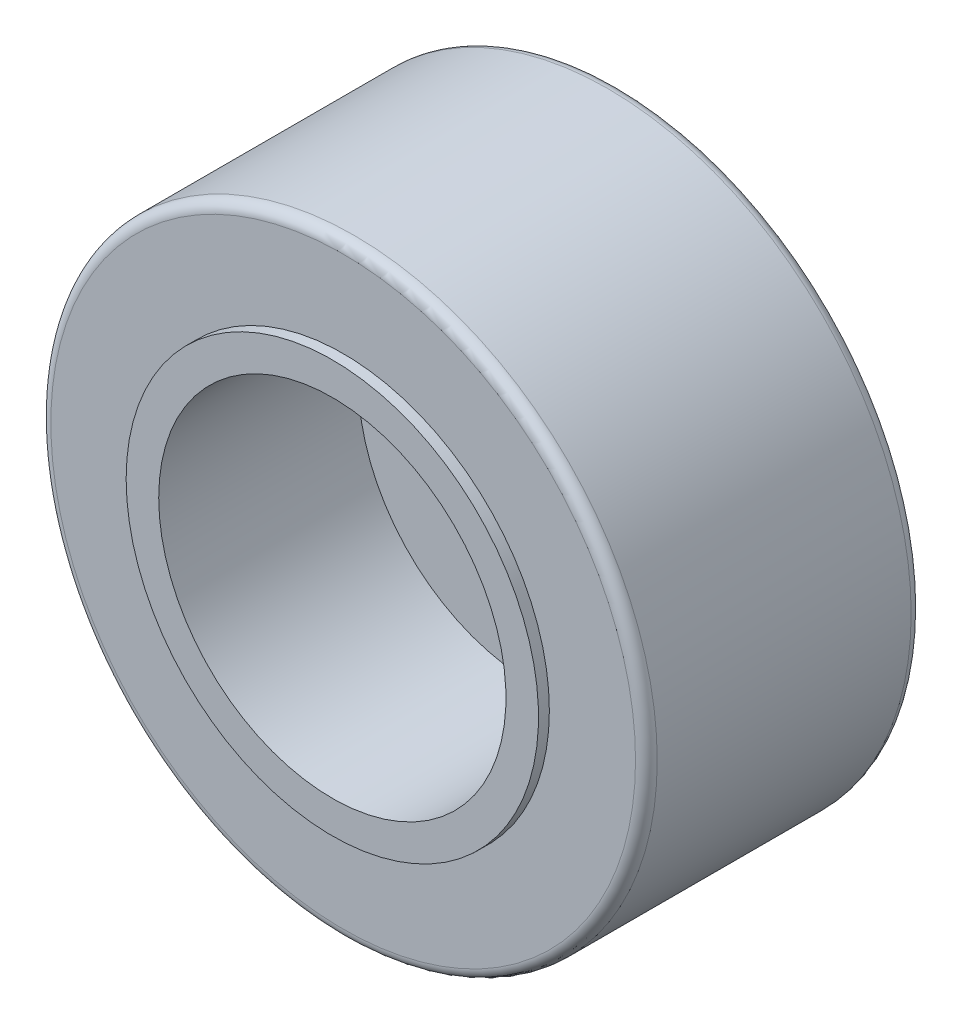
ISO-10303-21;
HEADER;
FILE_DESCRIPTION(('STEP AP214'),'2;1');
FILE_NAME('part.step','',(''),(''),'','','');
FILE_SCHEMA(('AUTOMOTIVE_DESIGN { 1 0 10303 214 1 1 1 1 }'));
ENDSEC;
DATA;
#1=APPLICATION_CONTEXT('core data for automotive mechanical design processes');
#2=APPLICATION_PROTOCOL_DEFINITION('international standard','automotive_design',2000,#1);
#3=PRODUCT_CONTEXT('',#1,'mechanical');
#4=PRODUCT('Part','Part','',(#3));
#5=PRODUCT_RELATED_PRODUCT_CATEGORY('part','',(#4));
#6=PRODUCT_DEFINITION_FORMATION('','',#4);
#7=PRODUCT_DEFINITION_CONTEXT('part definition',#1,'design');
#8=PRODUCT_DEFINITION('design','',#6,#7);
#9=PRODUCT_DEFINITION_SHAPE('','',#8);
#10=(LENGTH_UNIT() NAMED_UNIT(*) SI_UNIT(.MILLI.,.METRE.));
#11=(NAMED_UNIT(*) PLANE_ANGLE_UNIT() SI_UNIT($,.RADIAN.));
#12=(NAMED_UNIT(*) SI_UNIT($,.STERADIAN.) SOLID_ANGLE_UNIT());
#13=UNCERTAINTY_MEASURE_WITH_UNIT(LENGTH_MEASURE(1.E-05),#10,'distance_accuracy_value','');
#14=(GEOMETRIC_REPRESENTATION_CONTEXT(3) GLOBAL_UNCERTAINTY_ASSIGNED_CONTEXT((#13)) GLOBAL_UNIT_ASSIGNED_CONTEXT((#10,
#11,#12)) REPRESENTATION_CONTEXT('',''));
#15=CARTESIAN_POINT('',(0.,0.,0.));
#16=DIRECTION('',(0.,0.,1.));
#17=DIRECTION('',(1.,0.,0.));
#18=AXIS2_PLACEMENT_3D('',#15,#16,#17);
#19=CARTESIAN_POINT('',(0.,0.,12.7));
#20=DIRECTION('',(0.,0.,1.));
#21=DIRECTION('',(1.,0.,0.));
#22=AXIS2_PLACEMENT_3D('',#19,#20,#21);
#23=PLANE('',#22);
#24=CARTESIAN_POINT('',(0.,0.,12.7));
#25=DIRECTION('',(0.,0.,1.));
#26=DIRECTION('',(1.,0.,0.));
#27=AXIS2_PLACEMENT_3D('',#24,#25,#26);
#28=CIRCLE('',#27,9.5);
#29=CARTESIAN_POINT('',(9.5,0.,12.7));
#30=VERTEX_POINT('',#29);
#31=EDGE_CURVE('E10',#30,#30,#28,.T.);
#32=ORIENTED_EDGE('',*,*,#31,.F.);
#33=EDGE_LOOP('',(#32));
#34=FACE_BOUND('',#33,.T.);
#35=CARTESIAN_POINT('',(0.,0.,12.7));
#36=DIRECTION('',(0.,0.,1.));
#37=DIRECTION('',(1.,0.,0.));
#38=AXIS2_PLACEMENT_3D('',#35,#36,#37);
#39=CIRCLE('',#38,13.47);
#40=CARTESIAN_POINT('',(13.47,0.,12.7));
#41=VERTEX_POINT('',#40);
#42=EDGE_CURVE('E42',#41,#41,#39,.T.);
#43=ORIENTED_EDGE('',*,*,#42,.T.);
#44=EDGE_LOOP('',(#43));
#45=FACE_BOUND('',#44,.T.);
#46=ADVANCED_FACE('F35',(#34,#45),#23,.T.);
#47=CARTESIAN_POINT('',(0.,0.,0.));
#48=DIRECTION('',(0.,0.,1.));
#49=DIRECTION('',(1.,0.,0.));
#50=AXIS2_PLACEMENT_3D('',#47,#48,#49);
#51=PLANE('',#50);
#52=CARTESIAN_POINT('',(0.,0.,0.));
#53=DIRECTION('',(0.,0.,-1.));
#54=DIRECTION('',(-1.,0.,0.));
#55=AXIS2_PLACEMENT_3D('',#52,#53,#54);
#56=CIRCLE('',#55,9.5);
#57=CARTESIAN_POINT('',(-9.5,0.,0.));
#58=VERTEX_POINT('',#57);
#59=EDGE_CURVE('E76',#58,#58,#56,.T.);
#60=ORIENTED_EDGE('',*,*,#59,.F.);
#61=EDGE_LOOP('',(#60));
#62=FACE_BOUND('',#61,.T.);
#63=CARTESIAN_POINT('',(0.,0.,0.));
#64=DIRECTION('',(0.,0.,1.));
#65=DIRECTION('',(1.,0.,0.));
#66=AXIS2_PLACEMENT_3D('',#63,#64,#65);
#67=CIRCLE('',#66,13.47);
#68=CARTESIAN_POINT('',(13.47,0.,0.));
#69=VERTEX_POINT('',#68);
#70=EDGE_CURVE('E46',#69,#69,#67,.F.);
#71=ORIENTED_EDGE('',*,*,#70,.T.);
#72=EDGE_LOOP('',(#71));
#73=FACE_BOUND('',#72,.T.);
#74=ADVANCED_FACE('F83',(#62,#73),#51,.F.);
#75=CARTESIAN_POINT('',(0.,0.,12.7));
#76=DIRECTION('',(0.,0.,-1.));
#77=DIRECTION('',(-1.,0.,0.));
#78=AXIS2_PLACEMENT_3D('',#75,#76,#77);
#79=CYLINDRICAL_SURFACE('',#78,13.97);
#80=CARTESIAN_POINT('',(0.,0.,0.5));
#81=DIRECTION('',(0.,0.,1.));
#82=DIRECTION('',(1.,0.,0.));
#83=AXIS2_PLACEMENT_3D('',#80,#81,#82);
#84=CIRCLE('',#83,13.97);
#85=CARTESIAN_POINT('',(13.97,0.,0.5));
#86=VERTEX_POINT('',#85);
#87=EDGE_CURVE('E50',#86,#86,#84,.T.);
#88=ORIENTED_EDGE('',*,*,#87,.T.);
#89=EDGE_LOOP('',(#88));
#90=FACE_BOUND('',#89,.T.);
#91=CARTESIAN_POINT('',(0.,0.,12.2));
#92=DIRECTION('',(0.,0.,1.));
#93=DIRECTION('',(1.,0.,0.));
#94=AXIS2_PLACEMENT_3D('',#91,#92,#93);
#95=CIRCLE('',#94,13.97);
#96=CARTESIAN_POINT('',(13.97,0.,12.2));
#97=VERTEX_POINT('',#96);
#98=EDGE_CURVE('E55',#97,#97,#95,.F.);
#99=ORIENTED_EDGE('',*,*,#98,.T.);
#100=EDGE_LOOP('',(#99));
#101=FACE_BOUND('',#100,.T.);
#102=ADVANCED_FACE('F86',(#90,#101),#79,.T.);
#103=CARTESIAN_POINT('',(0.,0.,0.5));
#104=DIRECTION('',(0.,0.,1.));
#105=DIRECTION('',(1.,0.,0.));
#106=AXIS2_PLACEMENT_3D('',#103,#104,#105);
#107=TOROIDAL_SURFACE('',#106,13.47,0.5);
#108=ORIENTED_EDGE('',*,*,#70,.F.);
#109=EDGE_LOOP('',(#108));
#110=FACE_BOUND('',#109,.T.);
#111=ORIENTED_EDGE('',*,*,#87,.F.);
#112=EDGE_LOOP('',(#111));
#113=FACE_BOUND('',#112,.T.);
#114=ADVANCED_FACE('F90',(#110,#113),#107,.T.);
#115=CARTESIAN_POINT('',(0.,0.,12.2));
#116=DIRECTION('',(0.,0.,1.));
#117=DIRECTION('',(1.,0.,0.));
#118=AXIS2_PLACEMENT_3D('',#115,#116,#117);
#119=TOROIDAL_SURFACE('',#118,13.47,0.5);
#120=ORIENTED_EDGE('',*,*,#98,.F.);
#121=EDGE_LOOP('',(#120));
#122=FACE_BOUND('',#121,.T.);
#123=ORIENTED_EDGE('',*,*,#42,.F.);
#124=EDGE_LOOP('',(#123));
#125=FACE_BOUND('',#124,.T.);
#126=ADVANCED_FACE('F37',(#122,#125),#119,.T.);
#127=CARTESIAN_POINT('',(0.,0.,0.));
#128=DIRECTION('',(0.,0.,-1.));
#129=DIRECTION('',(-1.,0.,0.));
#130=AXIS2_PLACEMENT_3D('',#127,#128,#129);
#131=CYLINDRICAL_SURFACE('',#130,9.5);
#132=CARTESIAN_POINT('',(0.,0.,13.2));
#133=DIRECTION('',(0.,0.,-1.));
#134=DIRECTION('',(-1.,0.,0.));
#135=AXIS2_PLACEMENT_3D('',#132,#133,#134);
#136=CIRCLE('',#135,9.5);
#137=CARTESIAN_POINT('',(-9.5,0.,13.2));
#138=VERTEX_POINT('',#137);
#139=EDGE_CURVE('E58',#138,#138,#136,.T.);
#140=ORIENTED_EDGE('',*,*,#139,.T.);
#141=EDGE_LOOP('',(#140));
#142=FACE_BOUND('',#141,.T.);
#143=ORIENTED_EDGE('',*,*,#31,.T.);
#144=EDGE_LOOP('',(#143));
#145=FACE_BOUND('',#144,.T.);
#146=ADVANCED_FACE('F102',(#142,#145),#131,.T.);
#147=CARTESIAN_POINT('',(0.,9.5,13.2));
#148=DIRECTION('',(0.,0.,1.));
#149=DIRECTION('',(1.,0.,0.));
#150=AXIS2_PLACEMENT_3D('',#147,#148,#149);
#151=PLANE('',#150);
#152=CARTESIAN_POINT('',(0.,0.,13.2));
#153=DIRECTION('',(0.,0.,-1.));
#154=DIRECTION('',(-1.,0.,0.));
#155=AXIS2_PLACEMENT_3D('',#152,#153,#154);
#156=CIRCLE('',#155,8.);
#157=CARTESIAN_POINT('',(-8.,0.,13.2));
#158=VERTEX_POINT('',#157);
#159=EDGE_CURVE('E61',#158,#158,#156,.T.);
#160=ORIENTED_EDGE('',*,*,#159,.T.);
#161=EDGE_LOOP('',(#160));
#162=FACE_BOUND('',#161,.T.);
#163=ORIENTED_EDGE('',*,*,#139,.F.);
#164=EDGE_LOOP('',(#163));
#165=FACE_BOUND('',#164,.T.);
#166=ADVANCED_FACE('F106',(#162,#165),#151,.T.);
#167=CARTESIAN_POINT('',(0.,0.,0.));
#168=DIRECTION('',(0.,0.,-1.));
#169=DIRECTION('',(-1.,0.,0.));
#170=AXIS2_PLACEMENT_3D('',#167,#168,#169);
#171=CYLINDRICAL_SURFACE('',#170,8.);
#172=CARTESIAN_POINT('',(0.,0.,4.));
#173=DIRECTION('',(0.,0.,-1.));
#174=DIRECTION('',(-1.,0.,0.));
#175=AXIS2_PLACEMENT_3D('',#172,#173,#174);
#176=CIRCLE('',#175,8.);
#177=CARTESIAN_POINT('',(-8.,0.,4.));
#178=VERTEX_POINT('',#177);
#179=EDGE_CURVE('E64',#178,#178,#176,.T.);
#180=ORIENTED_EDGE('',*,*,#179,.T.);
#181=EDGE_LOOP('',(#180));
#182=FACE_BOUND('',#181,.T.);
#183=ORIENTED_EDGE('',*,*,#159,.F.);
#184=EDGE_LOOP('',(#183));
#185=FACE_BOUND('',#184,.T.);
#186=ADVANCED_FACE('F117',(#182,#185),#171,.F.);
#187=CARTESIAN_POINT('',(0.,8.,4.));
#188=DIRECTION('',(0.,0.,1.));
#189=DIRECTION('',(1.,0.,0.));
#190=AXIS2_PLACEMENT_3D('',#187,#188,#189);
#191=PLANE('',#190);
#192=CARTESIAN_POINT('',(0.,0.,4.));
#193=DIRECTION('',(0.,0.,-1.));
#194=DIRECTION('',(-1.,0.,0.));
#195=AXIS2_PLACEMENT_3D('',#192,#193,#194);
#196=CIRCLE('',#195,1.5);
#197=CARTESIAN_POINT('',(-1.5,0.,4.));
#198=VERTEX_POINT('',#197);
#199=EDGE_CURVE('E67',#198,#198,#196,.T.);
#200=ORIENTED_EDGE('',*,*,#199,.T.);
#201=EDGE_LOOP('',(#200));
#202=FACE_BOUND('',#201,.T.);
#203=ORIENTED_EDGE('',*,*,#179,.F.);
#204=EDGE_LOOP('',(#203));
#205=FACE_BOUND('',#204,.T.);
#206=ADVANCED_FACE('F121',(#202,#205),#191,.T.);
#207=CARTESIAN_POINT('',(0.,0.,0.));
#208=DIRECTION('',(0.,0.,-1.));
#209=DIRECTION('',(-1.,0.,0.));
#210=AXIS2_PLACEMENT_3D('',#207,#208,#209);
#211=CYLINDRICAL_SURFACE('',#210,1.5);
#212=CARTESIAN_POINT('',(0.,0.,-0.500000000000001));
#213=DIRECTION('',(0.,0.,-1.));
#214=DIRECTION('',(-1.,0.,0.));
#215=AXIS2_PLACEMENT_3D('',#212,#213,#214);
#216=CIRCLE('',#215,1.5);
#217=CARTESIAN_POINT('',(-1.5,0.,-0.500000000000001));
#218=VERTEX_POINT('',#217);
#219=EDGE_CURVE('E70',#218,#218,#216,.T.);
#220=ORIENTED_EDGE('',*,*,#219,.T.);
#221=EDGE_LOOP('',(#220));
#222=FACE_BOUND('',#221,.T.);
#223=ORIENTED_EDGE('',*,*,#199,.F.);
#224=EDGE_LOOP('',(#223));
#225=FACE_BOUND('',#224,.T.);
#226=ADVANCED_FACE('F125',(#222,#225),#211,.F.);
#227=CARTESIAN_POINT('',(0.,9.5,-0.5));
#228=DIRECTION('',(0.,0.,-1.));
#229=DIRECTION('',(-1.,0.,0.));
#230=AXIS2_PLACEMENT_3D('',#227,#228,#229);
#231=PLANE('',#230);
#232=CARTESIAN_POINT('',(0.,0.,-0.5));
#233=DIRECTION('',(0.,0.,-1.));
#234=DIRECTION('',(-1.,0.,0.));
#235=AXIS2_PLACEMENT_3D('',#232,#233,#234);
#236=CIRCLE('',#235,9.5);
#237=CARTESIAN_POINT('',(-9.5,0.,-0.5));
#238=VERTEX_POINT('',#237);
#239=EDGE_CURVE('E73',#238,#238,#236,.T.);
#240=ORIENTED_EDGE('',*,*,#239,.T.);
#241=EDGE_LOOP('',(#240));
#242=FACE_BOUND('',#241,.T.);
#243=ORIENTED_EDGE('',*,*,#219,.F.);
#244=EDGE_LOOP('',(#243));
#245=FACE_BOUND('',#244,.T.);
#246=ADVANCED_FACE('F129',(#242,#245),#231,.T.);
#247=CARTESIAN_POINT('',(0.,0.,0.));
#248=DIRECTION('',(0.,0.,-1.));
#249=DIRECTION('',(-1.,0.,0.));
#250=AXIS2_PLACEMENT_3D('',#247,#248,#249);
#251=CYLINDRICAL_SURFACE('',#250,9.5);
#252=ORIENTED_EDGE('',*,*,#59,.T.);
#253=EDGE_LOOP('',(#252));
#254=FACE_BOUND('',#253,.T.);
#255=ORIENTED_EDGE('',*,*,#239,.F.);
#256=EDGE_LOOP('',(#255));
#257=FACE_BOUND('',#256,.T.);
#258=ADVANCED_FACE('F80',(#254,#257),#251,.T.);
#259=CLOSED_SHELL('',(#46,#74,#102,#114,#126,#146,#166,#186,#206,#226,#246,#258));
#260=MANIFOLD_SOLID_BREP('B2',#259);
#261=ADVANCED_BREP_SHAPE_REPRESENTATION('',(#18,#260),#14);
#262=SHAPE_DEFINITION_REPRESENTATION(#9,#261);
ENDSEC;
END-ISO-10303-21;
